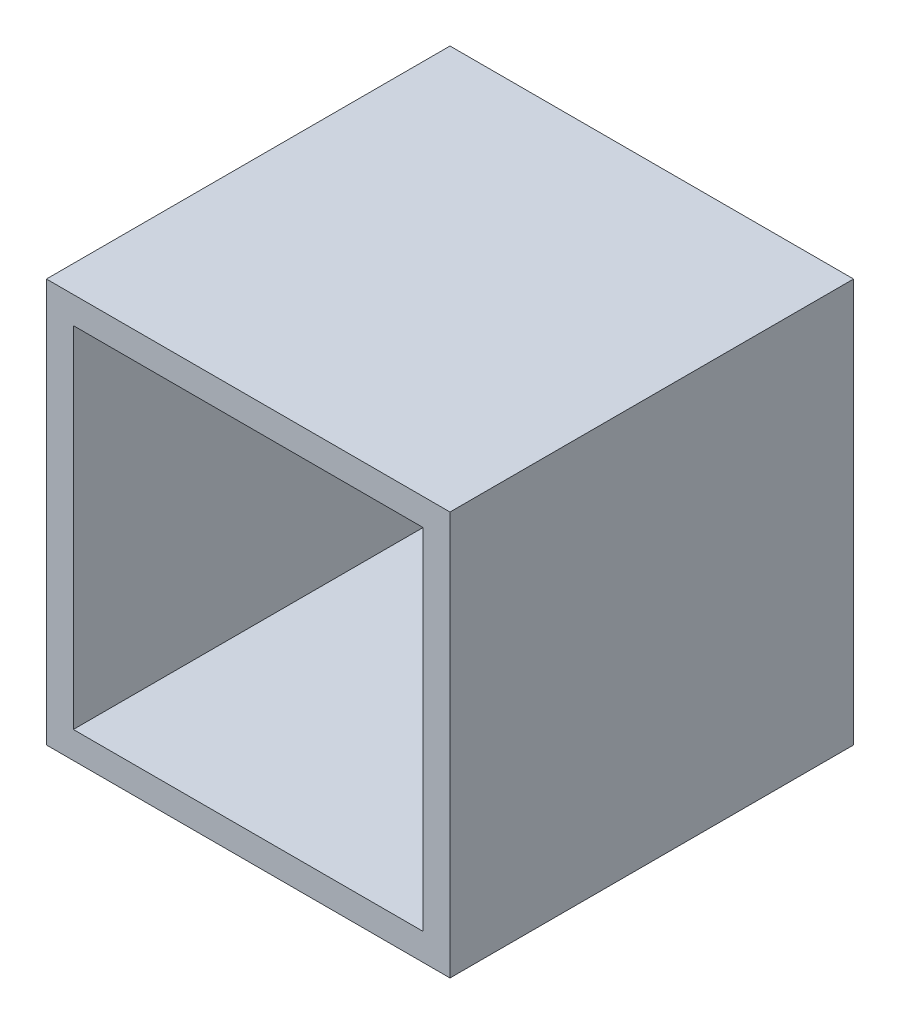
ISO-10303-21;
HEADER;
FILE_DESCRIPTION(('STEP AP214'),'2;1');
FILE_NAME('part.step','',(''),(''),'','','');
FILE_SCHEMA(('AUTOMOTIVE_DESIGN { 1 0 10303 214 1 1 1 1 }'));
ENDSEC;
DATA;
#1=APPLICATION_CONTEXT('core data for automotive mechanical design processes');
#2=APPLICATION_PROTOCOL_DEFINITION('international standard','automotive_design',2000,#1);
#3=PRODUCT_CONTEXT('',#1,'mechanical');
#4=PRODUCT('Part','Part','',(#3));
#5=PRODUCT_RELATED_PRODUCT_CATEGORY('part','',(#4));
#6=PRODUCT_DEFINITION_FORMATION('','',#4);
#7=PRODUCT_DEFINITION_CONTEXT('part definition',#1,'design');
#8=PRODUCT_DEFINITION('design','',#6,#7);
#9=PRODUCT_DEFINITION_SHAPE('','',#8);
#10=(LENGTH_UNIT() NAMED_UNIT(*) SI_UNIT(.MILLI.,.METRE.));
#11=(NAMED_UNIT(*) PLANE_ANGLE_UNIT() SI_UNIT($,.RADIAN.));
#12=(NAMED_UNIT(*) SI_UNIT($,.STERADIAN.) SOLID_ANGLE_UNIT());
#13=UNCERTAINTY_MEASURE_WITH_UNIT(LENGTH_MEASURE(1.E-05),#10,'distance_accuracy_value','');
#14=(GEOMETRIC_REPRESENTATION_CONTEXT(3) GLOBAL_UNCERTAINTY_ASSIGNED_CONTEXT((#13)) GLOBAL_UNIT_ASSIGNED_CONTEXT((#10,
#11,#12)) REPRESENTATION_CONTEXT('',''));
#15=CARTESIAN_POINT('',(0.,0.,0.));
#16=DIRECTION('',(0.,0.,1.));
#17=DIRECTION('',(1.,0.,0.));
#18=AXIS2_PLACEMENT_3D('',#15,#16,#17);
#19=CARTESIAN_POINT('',(0.,0.,30.));
#20=DIRECTION('',(0.,0.,1.));
#21=DIRECTION('',(1.,0.,0.));
#22=AXIS2_PLACEMENT_3D('',#19,#20,#21);
#23=PLANE('',#22);
#24=DIRECTION('',(0.,-1.,0.));
#25=VECTOR('',#24,1.);
#26=CARTESIAN_POINT('',(-4.62548566478165,27.5182805690849,30.));
#27=LINE('',#26,#25);
#28=CARTESIAN_POINT('',(-4.62548566478165,27.5182805690849,30.));
#29=VERTEX_POINT('',#28);
#30=CARTESIAN_POINT('',(-4.62548566478165,-2.48171943091514,30.));
#31=VERTEX_POINT('',#30);
#32=EDGE_CURVE('E173',#29,#31,#27,.T.);
#33=ORIENTED_EDGE('',*,*,#32,.T.);
#34=DIRECTION('',(1.,0.,0.));
#35=VECTOR('',#34,1.);
#36=CARTESIAN_POINT('',(-4.62548566478165,-2.48171943091514,30.));
#37=LINE('',#36,#35);
#38=CARTESIAN_POINT('',(25.3745143352184,-2.48171943091514,30.));
#39=VERTEX_POINT('',#38);
#40=EDGE_CURVE('E100',#31,#39,#37,.T.);
#41=ORIENTED_EDGE('',*,*,#40,.T.);
#42=DIRECTION('',(0.,1.,0.));
#43=VECTOR('',#42,1.);
#44=CARTESIAN_POINT('',(25.3745143352184,27.5182805690849,30.));
#45=LINE('',#44,#43);
#46=CARTESIAN_POINT('',(25.3745143352184,27.5182805690849,30.));
#47=VERTEX_POINT('',#46);
#48=EDGE_CURVE('E178',#39,#47,#45,.T.);
#49=ORIENTED_EDGE('',*,*,#48,.T.);
#50=DIRECTION('',(-1.,0.,0.));
#51=VECTOR('',#50,1.);
#52=CARTESIAN_POINT('',(-4.62548566478165,27.5182805690849,30.));
#53=LINE('',#52,#51);
#54=EDGE_CURVE('E72',#47,#29,#53,.T.);
#55=ORIENTED_EDGE('',*,*,#54,.T.);
#56=EDGE_LOOP('',(#33,#41,#49,#55));
#57=FACE_BOUND('',#56,.T.);
#58=DIRECTION('',(0.,-1.,0.));
#59=VECTOR('',#58,1.);
#60=CARTESIAN_POINT('',(-2.62548566478165,0.,30.));
#61=LINE('',#60,#59);
#62=CARTESIAN_POINT('',(-2.62548566478165,25.5182805690849,30.));
#63=VERTEX_POINT('',#62);
#64=CARTESIAN_POINT('',(-2.62548566478165,-0.481719430915135,30.));
#65=VERTEX_POINT('',#64);
#66=EDGE_CURVE('E154',#63,#65,#61,.T.);
#67=ORIENTED_EDGE('',*,*,#66,.F.);
#68=DIRECTION('',(1.,0.,0.));
#69=VECTOR('',#68,1.);
#70=CARTESIAN_POINT('',(0.,25.5182805690849,30.));
#71=LINE('',#70,#69);
#72=CARTESIAN_POINT('',(23.3745143352184,25.5182805690849,30.));
#73=VERTEX_POINT('',#72);
#74=EDGE_CURVE('E63',#63,#73,#71,.T.);
#75=ORIENTED_EDGE('',*,*,#74,.T.);
#76=DIRECTION('',(0.,-1.,0.));
#77=VECTOR('',#76,1.);
#78=CARTESIAN_POINT('',(23.3745143352184,0.,30.));
#79=LINE('',#78,#77);
#80=CARTESIAN_POINT('',(23.3745143352184,-0.481719430915135,30.));
#81=VERTEX_POINT('',#80);
#82=EDGE_CURVE('E140',#73,#81,#79,.T.);
#83=ORIENTED_EDGE('',*,*,#82,.T.);
#84=DIRECTION('',(1.,0.,0.));
#85=VECTOR('',#84,1.);
#86=CARTESIAN_POINT('',(0.,-0.481719430915135,30.));
#87=LINE('',#86,#85);
#88=EDGE_CURVE('E157',#65,#81,#87,.T.);
#89=ORIENTED_EDGE('',*,*,#88,.F.);
#90=EDGE_LOOP('',(#67,#75,#83,#89));
#91=FACE_BOUND('',#90,.T.);
#92=ADVANCED_FACE('F47',(#57,#91),#23,.T.);
#93=CARTESIAN_POINT('',(-4.62548566478165,27.5182805690849,30.));
#94=DIRECTION('',(1.,0.,0.));
#95=DIRECTION('',(0.,1.,0.));
#96=AXIS2_PLACEMENT_3D('',#93,#94,#95);
#97=PLANE('',#96);
#98=DIRECTION('',(0.,-1.,0.));
#99=VECTOR('',#98,1.);
#100=CARTESIAN_POINT('',(-4.62548566478165,27.5182805690849,0.));
#101=LINE('',#100,#99);
#102=CARTESIAN_POINT('',(-4.62548566478165,27.5182805690849,0.));
#103=VERTEX_POINT('',#102);
#104=CARTESIAN_POINT('',(-4.62548566478165,-2.48171943091514,0.));
#105=VERTEX_POINT('',#104);
#106=EDGE_CURVE('E167',#103,#105,#101,.T.);
#107=ORIENTED_EDGE('',*,*,#106,.T.);
#108=DIRECTION('',(0.,0.,-1.));
#109=VECTOR('',#108,1.);
#110=CARTESIAN_POINT('',(-4.62548566478165,-2.48171943091514,30.));
#111=LINE('',#110,#109);
#112=EDGE_CURVE('E11',#31,#105,#111,.T.);
#113=ORIENTED_EDGE('',*,*,#112,.F.);
#114=ORIENTED_EDGE('',*,*,#32,.F.);
#115=DIRECTION('',(0.,0.,-1.));
#116=VECTOR('',#115,1.);
#117=CARTESIAN_POINT('',(-4.62548566478165,27.5182805690849,30.));
#118=LINE('',#117,#116);
#119=EDGE_CURVE('E183',#29,#103,#118,.T.);
#120=ORIENTED_EDGE('',*,*,#119,.T.);
#121=EDGE_LOOP('',(#107,#113,#114,#120));
#122=FACE_BOUND('',#121,.T.);
#123=ADVANCED_FACE('F49',(#122),#97,.F.);
#124=CARTESIAN_POINT('',(-4.62548566478165,-2.48171943091514,30.));
#125=DIRECTION('',(0.,1.,0.));
#126=DIRECTION('',(0.,0.,1.));
#127=AXIS2_PLACEMENT_3D('',#124,#125,#126);
#128=PLANE('',#127);
#129=DIRECTION('',(1.,0.,0.));
#130=VECTOR('',#129,1.);
#131=CARTESIAN_POINT('',(-4.62548566478165,-2.48171943091514,0.));
#132=LINE('',#131,#130);
#133=CARTESIAN_POINT('',(25.3745143352184,-2.48171943091514,0.));
#134=VERTEX_POINT('',#133);
#135=EDGE_CURVE('E187',#105,#134,#132,.T.);
#136=ORIENTED_EDGE('',*,*,#135,.T.);
#137=DIRECTION('',(0.,0.,-1.));
#138=VECTOR('',#137,1.);
#139=CARTESIAN_POINT('',(25.3745143352184,-2.48171943091514,30.));
#140=LINE('',#139,#138);
#141=EDGE_CURVE('E56',#39,#134,#140,.T.);
#142=ORIENTED_EDGE('',*,*,#141,.F.);
#143=ORIENTED_EDGE('',*,*,#40,.F.);
#144=ORIENTED_EDGE('',*,*,#112,.T.);
#145=EDGE_LOOP('',(#136,#142,#143,#144));
#146=FACE_BOUND('',#145,.T.);
#147=ADVANCED_FACE('F220',(#146),#128,.F.);
#148=CARTESIAN_POINT('',(25.3745143352184,27.5182805690849,30.));
#149=DIRECTION('',(-1.,0.,0.));
#150=DIRECTION('',(0.,0.,1.));
#151=AXIS2_PLACEMENT_3D('',#148,#149,#150);
#152=PLANE('',#151);
#153=DIRECTION('',(0.,1.,0.));
#154=VECTOR('',#153,1.);
#155=CARTESIAN_POINT('',(25.3745143352184,27.5182805690849,0.));
#156=LINE('',#155,#154);
#157=CARTESIAN_POINT('',(25.3745143352184,27.5182805690849,0.));
#158=VERTEX_POINT('',#157);
#159=EDGE_CURVE('E190',#134,#158,#156,.T.);
#160=ORIENTED_EDGE('',*,*,#159,.T.);
#161=DIRECTION('',(0.,0.,-1.));
#162=VECTOR('',#161,1.);
#163=CARTESIAN_POINT('',(25.3745143352184,27.5182805690849,30.));
#164=LINE('',#163,#162);
#165=EDGE_CURVE('E197',#47,#158,#164,.T.);
#166=ORIENTED_EDGE('',*,*,#165,.F.);
#167=ORIENTED_EDGE('',*,*,#48,.F.);
#168=ORIENTED_EDGE('',*,*,#141,.T.);
#169=EDGE_LOOP('',(#160,#166,#167,#168));
#170=FACE_BOUND('',#169,.T.);
#171=ADVANCED_FACE('F204',(#170),#152,.F.);
#172=CARTESIAN_POINT('',(-4.62548566478165,27.5182805690849,30.));
#173=DIRECTION('',(0.,-1.,0.));
#174=DIRECTION('',(1.,0.,0.));
#175=AXIS2_PLACEMENT_3D('',#172,#173,#174);
#176=PLANE('',#175);
#177=DIRECTION('',(-1.,0.,0.));
#178=VECTOR('',#177,1.);
#179=CARTESIAN_POINT('',(-4.62548566478165,27.5182805690849,0.));
#180=LINE('',#179,#178);
#181=EDGE_CURVE('E93',#158,#103,#180,.T.);
#182=ORIENTED_EDGE('',*,*,#181,.T.);
#183=ORIENTED_EDGE('',*,*,#119,.F.);
#184=ORIENTED_EDGE('',*,*,#54,.F.);
#185=ORIENTED_EDGE('',*,*,#165,.T.);
#186=EDGE_LOOP('',(#182,#183,#184,#185));
#187=FACE_BOUND('',#186,.T.);
#188=ADVANCED_FACE('F212',(#187),#176,.F.);
#189=CARTESIAN_POINT('',(0.,0.,0.));
#190=DIRECTION('',(0.,0.,1.));
#191=DIRECTION('',(1.,0.,0.));
#192=AXIS2_PLACEMENT_3D('',#189,#190,#191);
#193=PLANE('',#192);
#194=ORIENTED_EDGE('',*,*,#106,.F.);
#195=ORIENTED_EDGE('',*,*,#181,.F.);
#196=ORIENTED_EDGE('',*,*,#159,.F.);
#197=ORIENTED_EDGE('',*,*,#135,.F.);
#198=EDGE_LOOP('',(#194,#195,#196,#197));
#199=FACE_BOUND('',#198,.T.);
#200=ADVANCED_FACE('F208',(#199),#193,.F.);
#201=CARTESIAN_POINT('',(0.,25.5182805690849,2.));
#202=DIRECTION('',(0.,-1.,0.));
#203=DIRECTION('',(0.,0.,-1.));
#204=AXIS2_PLACEMENT_3D('',#201,#202,#203);
#205=PLANE('',#204);
#206=ORIENTED_EDGE('',*,*,#74,.F.);
#207=DIRECTION('',(0.,0.,1.));
#208=VECTOR('',#207,1.);
#209=CARTESIAN_POINT('',(-2.62548566478165,25.5182805690849,2.));
#210=LINE('',#209,#208);
#211=CARTESIAN_POINT('',(-2.62548566478165,25.5182805690849,2.));
#212=VERTEX_POINT('',#211);
#213=EDGE_CURVE('E121',#212,#63,#210,.T.);
#214=ORIENTED_EDGE('',*,*,#213,.F.);
#215=DIRECTION('',(1.,0.,0.));
#216=VECTOR('',#215,1.);
#217=CARTESIAN_POINT('',(0.,25.5182805690849,2.));
#218=LINE('',#217,#216);
#219=CARTESIAN_POINT('',(23.3745143352184,25.5182805690849,2.));
#220=VERTEX_POINT('',#219);
#221=EDGE_CURVE('E124',#212,#220,#218,.T.);
#222=ORIENTED_EDGE('',*,*,#221,.T.);
#223=DIRECTION('',(0.,0.,1.));
#224=VECTOR('',#223,1.);
#225=CARTESIAN_POINT('',(23.3745143352184,25.5182805690849,2.));
#226=LINE('',#225,#224);
#227=EDGE_CURVE('E164',#220,#73,#226,.T.);
#228=ORIENTED_EDGE('',*,*,#227,.T.);
#229=EDGE_LOOP('',(#206,#214,#222,#228));
#230=FACE_BOUND('',#229,.T.);
#231=ADVANCED_FACE('F123',(#230),#205,.T.);
#232=CARTESIAN_POINT('',(23.3745143352184,0.,2.));
#233=DIRECTION('',(-1.,0.,0.));
#234=DIRECTION('',(0.,-1.,0.));
#235=AXIS2_PLACEMENT_3D('',#232,#233,#234);
#236=PLANE('',#235);
#237=ORIENTED_EDGE('',*,*,#82,.F.);
#238=ORIENTED_EDGE('',*,*,#227,.F.);
#239=DIRECTION('',(0.,-1.,0.));
#240=VECTOR('',#239,1.);
#241=CARTESIAN_POINT('',(23.3745143352184,0.,2.));
#242=LINE('',#241,#240);
#243=CARTESIAN_POINT('',(23.3745143352184,-0.481719430915135,2.));
#244=VERTEX_POINT('',#243);
#245=EDGE_CURVE('E132',#220,#244,#242,.T.);
#246=ORIENTED_EDGE('',*,*,#245,.T.);
#247=DIRECTION('',(0.,0.,1.));
#248=VECTOR('',#247,1.);
#249=CARTESIAN_POINT('',(23.3745143352184,-0.481719430915135,2.));
#250=LINE('',#249,#248);
#251=EDGE_CURVE('E168',#244,#81,#250,.T.);
#252=ORIENTED_EDGE('',*,*,#251,.T.);
#253=EDGE_LOOP('',(#237,#238,#246,#252));
#254=FACE_BOUND('',#253,.T.);
#255=ADVANCED_FACE('F231',(#254),#236,.T.);
#256=CARTESIAN_POINT('',(0.,-0.481719430915135,2.));
#257=DIRECTION('',(0.,-1.,0.));
#258=DIRECTION('',(1.,0.,0.));
#259=AXIS2_PLACEMENT_3D('',#256,#257,#258);
#260=PLANE('',#259);
#261=ORIENTED_EDGE('',*,*,#88,.T.);
#262=ORIENTED_EDGE('',*,*,#251,.F.);
#263=DIRECTION('',(1.,0.,0.));
#264=VECTOR('',#263,1.);
#265=CARTESIAN_POINT('',(0.,-0.481719430915135,2.));
#266=LINE('',#265,#264);
#267=CARTESIAN_POINT('',(-2.62548566478165,-0.481719430915135,2.));
#268=VERTEX_POINT('',#267);
#269=EDGE_CURVE('E145',#268,#244,#266,.T.);
#270=ORIENTED_EDGE('',*,*,#269,.F.);
#271=DIRECTION('',(0.,0.,1.));
#272=VECTOR('',#271,1.);
#273=CARTESIAN_POINT('',(-2.62548566478165,-0.481719430915135,2.));
#274=LINE('',#273,#272);
#275=EDGE_CURVE('E131',#268,#65,#274,.T.);
#276=ORIENTED_EDGE('',*,*,#275,.T.);
#277=EDGE_LOOP('',(#261,#262,#270,#276));
#278=FACE_BOUND('',#277,.T.);
#279=ADVANCED_FACE('F234',(#278),#260,.F.);
#280=CARTESIAN_POINT('',(-2.62548566478165,0.,2.));
#281=DIRECTION('',(-1.,0.,0.));
#282=DIRECTION('',(0.,-1.,0.));
#283=AXIS2_PLACEMENT_3D('',#280,#281,#282);
#284=PLANE('',#283);
#285=ORIENTED_EDGE('',*,*,#66,.T.);
#286=ORIENTED_EDGE('',*,*,#275,.F.);
#287=DIRECTION('',(0.,-1.,0.));
#288=VECTOR('',#287,1.);
#289=CARTESIAN_POINT('',(-2.62548566478165,0.,2.));
#290=LINE('',#289,#288);
#291=EDGE_CURVE('E138',#212,#268,#290,.T.);
#292=ORIENTED_EDGE('',*,*,#291,.F.);
#293=ORIENTED_EDGE('',*,*,#213,.T.);
#294=EDGE_LOOP('',(#285,#286,#292,#293));
#295=FACE_BOUND('',#294,.T.);
#296=ADVANCED_FACE('F142',(#295),#284,.F.);
#297=CARTESIAN_POINT('',(0.,0.,2.));
#298=DIRECTION('',(0.,0.,1.));
#299=DIRECTION('',(1.,0.,0.));
#300=AXIS2_PLACEMENT_3D('',#297,#298,#299);
#301=PLANE('',#300);
#302=ORIENTED_EDGE('',*,*,#221,.F.);
#303=ORIENTED_EDGE('',*,*,#291,.T.);
#304=ORIENTED_EDGE('',*,*,#269,.T.);
#305=ORIENTED_EDGE('',*,*,#245,.F.);
#306=EDGE_LOOP('',(#302,#303,#304,#305));
#307=FACE_BOUND('',#306,.T.);
#308=ADVANCED_FACE('F136',(#307),#301,.T.);
#309=CLOSED_SHELL('',(#92,#123,#147,#171,#188,#200,#231,#255,#279,#296,#308));
#310=MANIFOLD_SOLID_BREP('B2',#309);
#311=ADVANCED_BREP_SHAPE_REPRESENTATION('',(#18,#310),#14);
#312=SHAPE_DEFINITION_REPRESENTATION(#9,#311);
ENDSEC;
END-ISO-10303-21;
